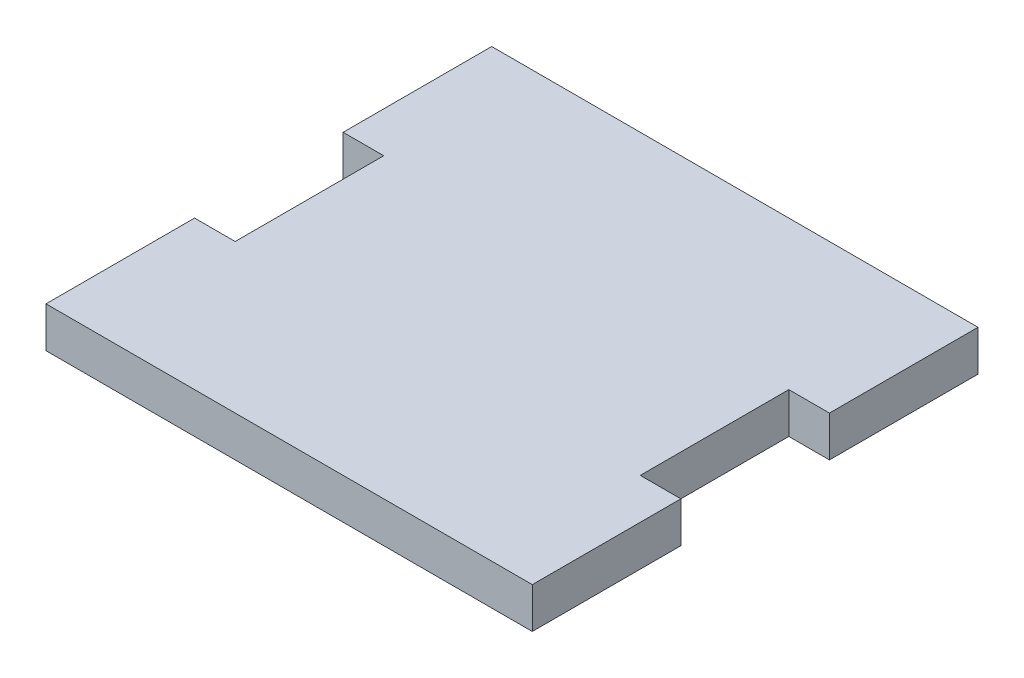
ISO-10303-21;
HEADER;
FILE_DESCRIPTION(('STEP AP214'),'2;1');
FILE_NAME('part.step','',(''),(''),'','','');
FILE_SCHEMA(('AUTOMOTIVE_DESIGN { 1 0 10303 214 1 1 1 1 }'));
ENDSEC;
DATA;
#1=APPLICATION_CONTEXT('core data for automotive mechanical design processes');
#2=APPLICATION_PROTOCOL_DEFINITION('international standard','automotive_design',2000,#1);
#3=PRODUCT_CONTEXT('',#1,'mechanical');
#4=PRODUCT('Part','Part','',(#3));
#5=PRODUCT_RELATED_PRODUCT_CATEGORY('part','',(#4));
#6=PRODUCT_DEFINITION_FORMATION('','',#4);
#7=PRODUCT_DEFINITION_CONTEXT('part definition',#1,'design');
#8=PRODUCT_DEFINITION('design','',#6,#7);
#9=PRODUCT_DEFINITION_SHAPE('','',#8);
#10=(LENGTH_UNIT() NAMED_UNIT(*) SI_UNIT(.MILLI.,.METRE.));
#11=(NAMED_UNIT(*) PLANE_ANGLE_UNIT() SI_UNIT($,.RADIAN.));
#12=(NAMED_UNIT(*) SI_UNIT($,.STERADIAN.) SOLID_ANGLE_UNIT());
#13=UNCERTAINTY_MEASURE_WITH_UNIT(LENGTH_MEASURE(1.E-05),#10,'distance_accuracy_value','');
#14=(GEOMETRIC_REPRESENTATION_CONTEXT(3) GLOBAL_UNCERTAINTY_ASSIGNED_CONTEXT((#13)) GLOBAL_UNIT_ASSIGNED_CONTEXT((#10,
#11,#12)) REPRESENTATION_CONTEXT('',''));
#15=CARTESIAN_POINT('',(0.,0.,0.));
#16=DIRECTION('',(0.,0.,1.));
#17=DIRECTION('',(1.,0.,0.));
#18=AXIS2_PLACEMENT_3D('',#15,#16,#17);
#19=CARTESIAN_POINT('',(0.,4.1,0.));
#20=DIRECTION('',(1.,0.,0.));
#21=DIRECTION('',(0.,0.,-1.));
#22=AXIS2_PLACEMENT_3D('',#19,#20,#21);
#23=PLANE('',#22);
#24=DIRECTION('',(0.,0.,1.));
#25=VECTOR('',#24,1.);
#26=CARTESIAN_POINT('',(0.,0.,0.));
#27=LINE('',#26,#25);
#28=CARTESIAN_POINT('',(0.,0.,-15.));
#29=VERTEX_POINT('',#28);
#30=CARTESIAN_POINT('',(0.,0.,0.));
#31=VERTEX_POINT('',#30);
#32=EDGE_CURVE('E153',#29,#31,#27,.T.);
#33=ORIENTED_EDGE('',*,*,#32,.T.);
#34=DIRECTION('',(0.,-1.,0.));
#35=VECTOR('',#34,1.);
#36=CARTESIAN_POINT('',(0.,4.1,0.));
#37=LINE('',#36,#35);
#38=CARTESIAN_POINT('',(0.,4.1,0.));
#39=VERTEX_POINT('',#38);
#40=EDGE_CURVE('E11',#39,#31,#37,.T.);
#41=ORIENTED_EDGE('',*,*,#40,.F.);
#42=DIRECTION('',(0.,0.,1.));
#43=VECTOR('',#42,1.);
#44=CARTESIAN_POINT('',(0.,4.1,0.));
#45=LINE('',#44,#43);
#46=CARTESIAN_POINT('',(0.,4.1,-15.));
#47=VERTEX_POINT('',#46);
#48=EDGE_CURVE('E175',#47,#39,#45,.T.);
#49=ORIENTED_EDGE('',*,*,#48,.F.);
#50=DIRECTION('',(0.,-1.,0.));
#51=VECTOR('',#50,1.);
#52=CARTESIAN_POINT('',(0.,4.1,-15.));
#53=LINE('',#52,#51);
#54=EDGE_CURVE('E149',#47,#29,#53,.T.);
#55=ORIENTED_EDGE('',*,*,#54,.T.);
#56=EDGE_LOOP('',(#33,#41,#49,#55));
#57=FACE_BOUND('',#56,.T.);
#58=ADVANCED_FACE('F33',(#57),#23,.F.);
#59=CARTESIAN_POINT('',(4.1,4.1,0.));
#60=DIRECTION('',(0.,0.,-1.));
#61=DIRECTION('',(-1.,0.,0.));
#62=AXIS2_PLACEMENT_3D('',#59,#60,#61);
#63=PLANE('',#62);
#64=DIRECTION('',(1.,0.,0.));
#65=VECTOR('',#64,1.);
#66=CARTESIAN_POINT('',(4.1,0.,0.));
#67=LINE('',#66,#65);
#68=CARTESIAN_POINT('',(4.1,0.,0.));
#69=VERTEX_POINT('',#68);
#70=EDGE_CURVE('E156',#31,#69,#67,.T.);
#71=ORIENTED_EDGE('',*,*,#70,.T.);
#72=DIRECTION('',(0.,-1.,0.));
#73=VECTOR('',#72,1.);
#74=CARTESIAN_POINT('',(4.1,4.1,0.));
#75=LINE('',#74,#73);
#76=CARTESIAN_POINT('',(4.1,4.1,0.));
#77=VERTEX_POINT('',#76);
#78=EDGE_CURVE('E41',#77,#69,#75,.T.);
#79=ORIENTED_EDGE('',*,*,#78,.F.);
#80=DIRECTION('',(1.,0.,0.));
#81=VECTOR('',#80,1.);
#82=CARTESIAN_POINT('',(4.1,4.1,0.));
#83=LINE('',#82,#81);
#84=EDGE_CURVE('E104',#39,#77,#83,.T.);
#85=ORIENTED_EDGE('',*,*,#84,.F.);
#86=ORIENTED_EDGE('',*,*,#40,.T.);
#87=EDGE_LOOP('',(#71,#79,#85,#86));
#88=FACE_BOUND('',#87,.T.);
#89=ADVANCED_FACE('F253',(#88),#63,.F.);
#90=CARTESIAN_POINT('',(4.1,4.1,0.));
#91=DIRECTION('',(1.,0.,0.));
#92=DIRECTION('',(0.,0.,-1.));
#93=AXIS2_PLACEMENT_3D('',#90,#91,#92);
#94=PLANE('',#93);
#95=DIRECTION('',(0.,0.,1.));
#96=VECTOR('',#95,1.);
#97=CARTESIAN_POINT('',(4.1,0.,0.));
#98=LINE('',#97,#96);
#99=CARTESIAN_POINT('',(4.1,0.,15.));
#100=VERTEX_POINT('',#99);
#101=EDGE_CURVE('E158',#69,#100,#98,.T.);
#102=ORIENTED_EDGE('',*,*,#101,.T.);
#103=DIRECTION('',(0.,-1.,0.));
#104=VECTOR('',#103,1.);
#105=CARTESIAN_POINT('',(4.1,4.1,15.));
#106=LINE('',#105,#104);
#107=CARTESIAN_POINT('',(4.1,4.1,15.));
#108=VERTEX_POINT('',#107);
#109=EDGE_CURVE('E194',#108,#100,#106,.T.);
#110=ORIENTED_EDGE('',*,*,#109,.F.);
#111=DIRECTION('',(0.,0.,1.));
#112=VECTOR('',#111,1.);
#113=CARTESIAN_POINT('',(4.1,4.1,0.));
#114=LINE('',#113,#112);
#115=EDGE_CURVE('E202',#77,#108,#114,.T.);
#116=ORIENTED_EDGE('',*,*,#115,.F.);
#117=ORIENTED_EDGE('',*,*,#78,.T.);
#118=EDGE_LOOP('',(#102,#110,#116,#117));
#119=FACE_BOUND('',#118,.T.);
#120=ADVANCED_FACE('F200',(#119),#94,.F.);
#121=CARTESIAN_POINT('',(0.,4.1,15.));
#122=DIRECTION('',(0.,0.,1.));
#123=DIRECTION('',(1.,0.,0.));
#124=AXIS2_PLACEMENT_3D('',#121,#122,#123);
#125=PLANE('',#124);
#126=DIRECTION('',(-1.,0.,0.));
#127=VECTOR('',#126,1.);
#128=CARTESIAN_POINT('',(0.,0.,15.));
#129=LINE('',#128,#127);
#130=CARTESIAN_POINT('',(0.,0.,15.));
#131=VERTEX_POINT('',#130);
#132=EDGE_CURVE('E160',#100,#131,#129,.T.);
#133=ORIENTED_EDGE('',*,*,#132,.T.);
#134=DIRECTION('',(0.,-1.,0.));
#135=VECTOR('',#134,1.);
#136=CARTESIAN_POINT('',(0.,4.1,15.));
#137=LINE('',#136,#135);
#138=CARTESIAN_POINT('',(0.,4.1,15.));
#139=VERTEX_POINT('',#138);
#140=EDGE_CURVE('E191',#139,#131,#137,.T.);
#141=ORIENTED_EDGE('',*,*,#140,.F.);
#142=DIRECTION('',(-1.,0.,0.));
#143=VECTOR('',#142,1.);
#144=CARTESIAN_POINT('',(0.,4.1,15.));
#145=LINE('',#144,#143);
#146=EDGE_CURVE('E220',#108,#139,#145,.T.);
#147=ORIENTED_EDGE('',*,*,#146,.F.);
#148=ORIENTED_EDGE('',*,*,#109,.T.);
#149=EDGE_LOOP('',(#133,#141,#147,#148));
#150=FACE_BOUND('',#149,.T.);
#151=ADVANCED_FACE('F211',(#150),#125,.F.);
#152=CARTESIAN_POINT('',(0.,4.1,15.));
#153=DIRECTION('',(1.,0.,0.));
#154=DIRECTION('',(0.,0.,-1.));
#155=AXIS2_PLACEMENT_3D('',#152,#153,#154);
#156=PLANE('',#155);
#157=DIRECTION('',(0.,0.,1.));
#158=VECTOR('',#157,1.);
#159=CARTESIAN_POINT('',(0.,0.,15.));
#160=LINE('',#159,#158);
#161=CARTESIAN_POINT('',(0.,0.,30.));
#162=VERTEX_POINT('',#161);
#163=EDGE_CURVE('E162',#131,#162,#160,.T.);
#164=ORIENTED_EDGE('',*,*,#163,.T.);
#165=DIRECTION('',(0.,-1.,0.));
#166=VECTOR('',#165,1.);
#167=CARTESIAN_POINT('',(0.,4.1,30.));
#168=LINE('',#167,#166);
#169=CARTESIAN_POINT('',(0.,4.1,30.));
#170=VERTEX_POINT('',#169);
#171=EDGE_CURVE('E188',#170,#162,#168,.T.);
#172=ORIENTED_EDGE('',*,*,#171,.F.);
#173=DIRECTION('',(0.,0.,1.));
#174=VECTOR('',#173,1.);
#175=CARTESIAN_POINT('',(0.,4.1,15.));
#176=LINE('',#175,#174);
#177=EDGE_CURVE('E217',#139,#170,#176,.T.);
#178=ORIENTED_EDGE('',*,*,#177,.F.);
#179=ORIENTED_EDGE('',*,*,#140,.T.);
#180=EDGE_LOOP('',(#164,#172,#178,#179));
#181=FACE_BOUND('',#180,.T.);
#182=ADVANCED_FACE('F215',(#181),#156,.F.);
#183=CARTESIAN_POINT('',(0.,4.1,30.));
#184=DIRECTION('',(0.,0.,-1.));
#185=DIRECTION('',(-1.,0.,0.));
#186=AXIS2_PLACEMENT_3D('',#183,#184,#185);
#187=PLANE('',#186);
#188=DIRECTION('',(1.,0.,0.));
#189=VECTOR('',#188,1.);
#190=CARTESIAN_POINT('',(0.,0.,30.));
#191=LINE('',#190,#189);
#192=CARTESIAN_POINT('',(49.1,0.,30.));
#193=VERTEX_POINT('',#192);
#194=EDGE_CURVE('E164',#162,#193,#191,.T.);
#195=ORIENTED_EDGE('',*,*,#194,.T.);
#196=DIRECTION('',(0.,-1.,0.));
#197=VECTOR('',#196,1.);
#198=CARTESIAN_POINT('',(49.1,4.1,30.));
#199=LINE('',#198,#197);
#200=CARTESIAN_POINT('',(49.1,4.1,30.));
#201=VERTEX_POINT('',#200);
#202=EDGE_CURVE('E185',#201,#193,#199,.T.);
#203=ORIENTED_EDGE('',*,*,#202,.F.);
#204=DIRECTION('',(1.,0.,0.));
#205=VECTOR('',#204,1.);
#206=CARTESIAN_POINT('',(0.,4.1,30.));
#207=LINE('',#206,#205);
#208=EDGE_CURVE('E219',#170,#201,#207,.T.);
#209=ORIENTED_EDGE('',*,*,#208,.F.);
#210=ORIENTED_EDGE('',*,*,#171,.T.);
#211=EDGE_LOOP('',(#195,#203,#209,#210));
#212=FACE_BOUND('',#211,.T.);
#213=ADVANCED_FACE('F266',(#212),#187,.F.);
#214=CARTESIAN_POINT('',(49.1,4.1,15.));
#215=DIRECTION('',(-1.,0.,0.));
#216=DIRECTION('',(0.,0.,1.));
#217=AXIS2_PLACEMENT_3D('',#214,#215,#216);
#218=PLANE('',#217);
#219=DIRECTION('',(0.,0.,-1.));
#220=VECTOR('',#219,1.);
#221=CARTESIAN_POINT('',(49.1,0.,15.));
#222=LINE('',#221,#220);
#223=CARTESIAN_POINT('',(49.1,0.,15.));
#224=VERTEX_POINT('',#223);
#225=EDGE_CURVE('E166',#193,#224,#222,.T.);
#226=ORIENTED_EDGE('',*,*,#225,.T.);
#227=DIRECTION('',(0.,-1.,0.));
#228=VECTOR('',#227,1.);
#229=CARTESIAN_POINT('',(49.1,4.1,15.));
#230=LINE('',#229,#228);
#231=CARTESIAN_POINT('',(49.1,4.1,15.));
#232=VERTEX_POINT('',#231);
#233=EDGE_CURVE('E182',#232,#224,#230,.T.);
#234=ORIENTED_EDGE('',*,*,#233,.F.);
#235=DIRECTION('',(0.,0.,-1.));
#236=VECTOR('',#235,1.);
#237=CARTESIAN_POINT('',(49.1,4.1,15.));
#238=LINE('',#237,#236);
#239=EDGE_CURVE('E222',#201,#232,#238,.T.);
#240=ORIENTED_EDGE('',*,*,#239,.F.);
#241=ORIENTED_EDGE('',*,*,#202,.T.);
#242=EDGE_LOOP('',(#226,#234,#240,#241));
#243=FACE_BOUND('',#242,.T.);
#244=ADVANCED_FACE('F269',(#243),#218,.F.);
#245=CARTESIAN_POINT('',(45.,4.1,15.));
#246=DIRECTION('',(0.,0.,1.));
#247=DIRECTION('',(1.,0.,0.));
#248=AXIS2_PLACEMENT_3D('',#245,#246,#247);
#249=PLANE('',#248);
#250=DIRECTION('',(-1.,0.,0.));
#251=VECTOR('',#250,1.);
#252=CARTESIAN_POINT('',(45.,0.,15.));
#253=LINE('',#252,#251);
#254=CARTESIAN_POINT('',(45.,0.,15.));
#255=VERTEX_POINT('',#254);
#256=EDGE_CURVE('E168',#224,#255,#253,.T.);
#257=ORIENTED_EDGE('',*,*,#256,.T.);
#258=DIRECTION('',(0.,-1.,0.));
#259=VECTOR('',#258,1.);
#260=CARTESIAN_POINT('',(45.,4.1,15.));
#261=LINE('',#260,#259);
#262=CARTESIAN_POINT('',(45.,4.1,15.));
#263=VERTEX_POINT('',#262);
#264=EDGE_CURVE('E179',#263,#255,#261,.T.);
#265=ORIENTED_EDGE('',*,*,#264,.F.);
#266=DIRECTION('',(-1.,0.,0.));
#267=VECTOR('',#266,1.);
#268=CARTESIAN_POINT('',(45.,4.1,15.));
#269=LINE('',#268,#267);
#270=EDGE_CURVE('E228',#232,#263,#269,.T.);
#271=ORIENTED_EDGE('',*,*,#270,.F.);
#272=ORIENTED_EDGE('',*,*,#233,.T.);
#273=EDGE_LOOP('',(#257,#265,#271,#272));
#274=FACE_BOUND('',#273,.T.);
#275=ADVANCED_FACE('F234',(#274),#249,.F.);
#276=CARTESIAN_POINT('',(45.,4.1,0.));
#277=DIRECTION('',(-1.,0.,0.));
#278=DIRECTION('',(0.,0.,1.));
#279=AXIS2_PLACEMENT_3D('',#276,#277,#278);
#280=PLANE('',#279);
#281=DIRECTION('',(0.,0.,-1.));
#282=VECTOR('',#281,1.);
#283=CARTESIAN_POINT('',(45.,0.,0.));
#284=LINE('',#283,#282);
#285=CARTESIAN_POINT('',(45.,0.,0.));
#286=VERTEX_POINT('',#285);
#287=EDGE_CURVE('E170',#255,#286,#284,.T.);
#288=ORIENTED_EDGE('',*,*,#287,.T.);
#289=DIRECTION('',(0.,-1.,0.));
#290=VECTOR('',#289,1.);
#291=CARTESIAN_POINT('',(45.,4.1,0.));
#292=LINE('',#291,#290);
#293=CARTESIAN_POINT('',(45.,4.1,0.));
#294=VERTEX_POINT('',#293);
#295=EDGE_CURVE('E144',#294,#286,#292,.T.);
#296=ORIENTED_EDGE('',*,*,#295,.F.);
#297=DIRECTION('',(0.,0.,-1.));
#298=VECTOR('',#297,1.);
#299=CARTESIAN_POINT('',(45.,4.1,0.));
#300=LINE('',#299,#298);
#301=EDGE_CURVE('E135',#263,#294,#300,.T.);
#302=ORIENTED_EDGE('',*,*,#301,.F.);
#303=ORIENTED_EDGE('',*,*,#264,.T.);
#304=EDGE_LOOP('',(#288,#296,#302,#303));
#305=FACE_BOUND('',#304,.T.);
#306=ADVANCED_FACE('F238',(#305),#280,.F.);
#307=CARTESIAN_POINT('',(45.,4.1,0.));
#308=DIRECTION('',(0.,0.,-1.));
#309=DIRECTION('',(-1.,0.,0.));
#310=AXIS2_PLACEMENT_3D('',#307,#308,#309);
#311=PLANE('',#310);
#312=DIRECTION('',(1.,0.,0.));
#313=VECTOR('',#312,1.);
#314=CARTESIAN_POINT('',(45.,0.,0.));
#315=LINE('',#314,#313);
#316=CARTESIAN_POINT('',(49.1,0.,0.));
#317=VERTEX_POINT('',#316);
#318=EDGE_CURVE('E143',#286,#317,#315,.T.);
#319=ORIENTED_EDGE('',*,*,#318,.T.);
#320=DIRECTION('',(0.,-1.,0.));
#321=VECTOR('',#320,1.);
#322=CARTESIAN_POINT('',(49.1,4.1,0.));
#323=LINE('',#322,#321);
#324=CARTESIAN_POINT('',(49.1,4.1,0.));
#325=VERTEX_POINT('',#324);
#326=EDGE_CURVE('E140',#325,#317,#323,.T.);
#327=ORIENTED_EDGE('',*,*,#326,.F.);
#328=DIRECTION('',(1.,0.,0.));
#329=VECTOR('',#328,1.);
#330=CARTESIAN_POINT('',(45.,4.1,0.));
#331=LINE('',#330,#329);
#332=EDGE_CURVE('E129',#294,#325,#331,.T.);
#333=ORIENTED_EDGE('',*,*,#332,.F.);
#334=ORIENTED_EDGE('',*,*,#295,.T.);
#335=EDGE_LOOP('',(#319,#327,#333,#334));
#336=FACE_BOUND('',#335,.T.);
#337=ADVANCED_FACE('F141',(#336),#311,.F.);
#338=CARTESIAN_POINT('',(49.1,4.1,0.));
#339=DIRECTION('',(-1.,0.,0.));
#340=DIRECTION('',(0.,0.,1.));
#341=AXIS2_PLACEMENT_3D('',#338,#339,#340);
#342=PLANE('',#341);
#343=DIRECTION('',(0.,0.,-1.));
#344=VECTOR('',#343,1.);
#345=CARTESIAN_POINT('',(49.1,0.,0.));
#346=LINE('',#345,#344);
#347=CARTESIAN_POINT('',(49.1,0.,-15.));
#348=VERTEX_POINT('',#347);
#349=EDGE_CURVE('E90',#317,#348,#346,.T.);
#350=ORIENTED_EDGE('',*,*,#349,.T.);
#351=DIRECTION('',(0.,-1.,0.));
#352=VECTOR('',#351,1.);
#353=CARTESIAN_POINT('',(49.1,4.1,-15.));
#354=LINE('',#353,#352);
#355=CARTESIAN_POINT('',(49.1,4.1,-15.));
#356=VERTEX_POINT('',#355);
#357=EDGE_CURVE('E145',#356,#348,#354,.T.);
#358=ORIENTED_EDGE('',*,*,#357,.F.);
#359=DIRECTION('',(0.,0.,-1.));
#360=VECTOR('',#359,1.);
#361=CARTESIAN_POINT('',(49.1,4.1,0.));
#362=LINE('',#361,#360);
#363=EDGE_CURVE('E133',#325,#356,#362,.T.);
#364=ORIENTED_EDGE('',*,*,#363,.F.);
#365=ORIENTED_EDGE('',*,*,#326,.T.);
#366=EDGE_LOOP('',(#350,#358,#364,#365));
#367=FACE_BOUND('',#366,.T.);
#368=ADVANCED_FACE('F147',(#367),#342,.F.);
#369=CARTESIAN_POINT('',(0.,4.1,-15.));
#370=DIRECTION('',(0.,0.,1.));
#371=DIRECTION('',(1.,0.,0.));
#372=AXIS2_PLACEMENT_3D('',#369,#370,#371);
#373=PLANE('',#372);
#374=DIRECTION('',(-1.,0.,0.));
#375=VECTOR('',#374,1.);
#376=CARTESIAN_POINT('',(0.,0.,-15.));
#377=LINE('',#376,#375);
#378=EDGE_CURVE('E96',#348,#29,#377,.T.);
#379=ORIENTED_EDGE('',*,*,#378,.T.);
#380=ORIENTED_EDGE('',*,*,#54,.F.);
#381=DIRECTION('',(-1.,0.,0.));
#382=VECTOR('',#381,1.);
#383=CARTESIAN_POINT('',(0.,4.1,-15.));
#384=LINE('',#383,#382);
#385=EDGE_CURVE('E49',#356,#47,#384,.T.);
#386=ORIENTED_EDGE('',*,*,#385,.F.);
#387=ORIENTED_EDGE('',*,*,#357,.T.);
#388=EDGE_LOOP('',(#379,#380,#386,#387));
#389=FACE_BOUND('',#388,.T.);
#390=ADVANCED_FACE('F242',(#389),#373,.F.);
#391=CARTESIAN_POINT('',(0.,4.1,-15.));
#392=DIRECTION('',(0.,-1.,0.));
#393=DIRECTION('',(0.,0.,-1.));
#394=AXIS2_PLACEMENT_3D('',#391,#392,#393);
#395=PLANE('',#394);
#396=ORIENTED_EDGE('',*,*,#48,.T.);
#397=ORIENTED_EDGE('',*,*,#84,.T.);
#398=ORIENTED_EDGE('',*,*,#115,.T.);
#399=ORIENTED_EDGE('',*,*,#146,.T.);
#400=ORIENTED_EDGE('',*,*,#177,.T.);
#401=ORIENTED_EDGE('',*,*,#208,.T.);
#402=ORIENTED_EDGE('',*,*,#239,.T.);
#403=ORIENTED_EDGE('',*,*,#270,.T.);
#404=ORIENTED_EDGE('',*,*,#301,.T.);
#405=ORIENTED_EDGE('',*,*,#332,.T.);
#406=ORIENTED_EDGE('',*,*,#363,.T.);
#407=ORIENTED_EDGE('',*,*,#385,.T.);
#408=EDGE_LOOP('',(#396,#397,#398,#399,#400,#401,#402,#403,#404,#405,#406,#407));
#409=FACE_BOUND('',#408,.T.);
#410=ADVANCED_FACE('F131',(#409),#395,.F.);
#411=CARTESIAN_POINT('',(0.,0.,-15.));
#412=DIRECTION('',(0.,-1.,0.));
#413=DIRECTION('',(0.,0.,-1.));
#414=AXIS2_PLACEMENT_3D('',#411,#412,#413);
#415=PLANE('',#414);
#416=ORIENTED_EDGE('',*,*,#32,.F.);
#417=ORIENTED_EDGE('',*,*,#378,.F.);
#418=ORIENTED_EDGE('',*,*,#349,.F.);
#419=ORIENTED_EDGE('',*,*,#318,.F.);
#420=ORIENTED_EDGE('',*,*,#287,.F.);
#421=ORIENTED_EDGE('',*,*,#256,.F.);
#422=ORIENTED_EDGE('',*,*,#225,.F.);
#423=ORIENTED_EDGE('',*,*,#194,.F.);
#424=ORIENTED_EDGE('',*,*,#163,.F.);
#425=ORIENTED_EDGE('',*,*,#132,.F.);
#426=ORIENTED_EDGE('',*,*,#101,.F.);
#427=ORIENTED_EDGE('',*,*,#70,.F.);
#428=EDGE_LOOP('',(#416,#417,#418,#419,#420,#421,#422,#423,#424,#425,#426,#427));
#429=FACE_BOUND('',#428,.T.);
#430=ADVANCED_FACE('F206',(#429),#415,.T.);
#431=CLOSED_SHELL('',(#58,#89,#120,#151,#182,#213,#244,#275,#306,#337,#368,#390,#410,#430));
#432=MANIFOLD_SOLID_BREP('B2',#431);
#433=ADVANCED_BREP_SHAPE_REPRESENTATION('',(#18,#432),#14);
#434=SHAPE_DEFINITION_REPRESENTATION(#9,#433);
ENDSEC;
END-ISO-10303-21;
